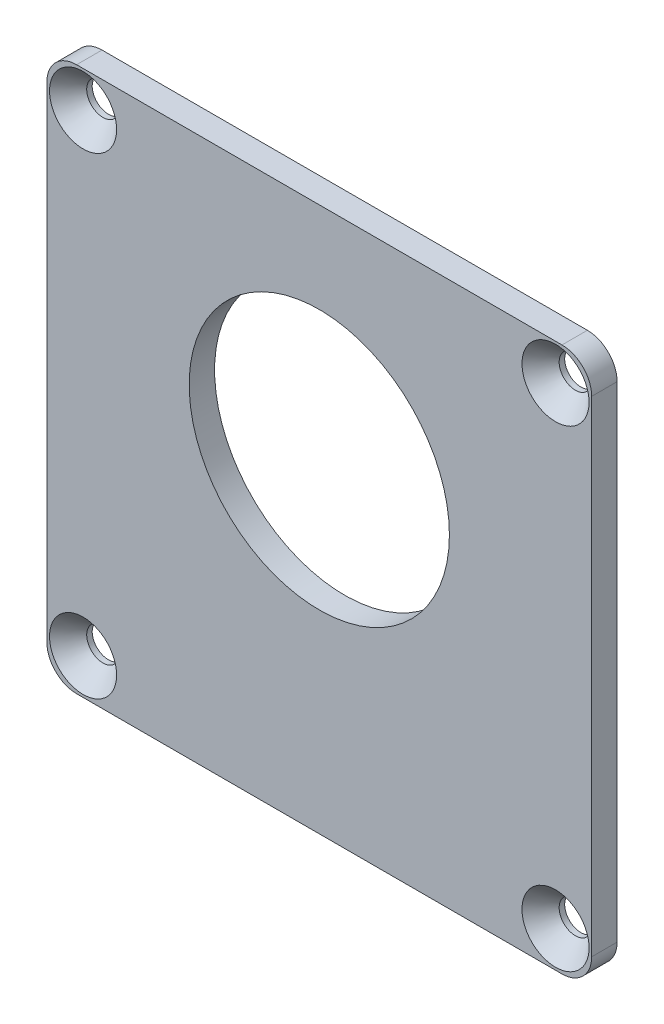
ISO-10303-21;
HEADER;
FILE_DESCRIPTION(('STEP AP214'),'2;1');
FILE_NAME('part.step','',(''),(''),'','','');
FILE_SCHEMA(('AUTOMOTIVE_DESIGN { 1 0 10303 214 1 1 1 1 }'));
ENDSEC;
DATA;
#1=APPLICATION_CONTEXT('core data for automotive mechanical design processes');
#2=APPLICATION_PROTOCOL_DEFINITION('international standard','automotive_design',2000,#1);
#3=PRODUCT_CONTEXT('',#1,'mechanical');
#4=PRODUCT('Part','Part','',(#3));
#5=PRODUCT_RELATED_PRODUCT_CATEGORY('part','',(#4));
#6=PRODUCT_DEFINITION_FORMATION('','',#4);
#7=PRODUCT_DEFINITION_CONTEXT('part definition',#1,'design');
#8=PRODUCT_DEFINITION('design','',#6,#7);
#9=PRODUCT_DEFINITION_SHAPE('','',#8);
#10=(LENGTH_UNIT() NAMED_UNIT(*) SI_UNIT(.MILLI.,.METRE.));
#11=(NAMED_UNIT(*) PLANE_ANGLE_UNIT() SI_UNIT($,.RADIAN.));
#12=(NAMED_UNIT(*) SI_UNIT($,.STERADIAN.) SOLID_ANGLE_UNIT());
#13=UNCERTAINTY_MEASURE_WITH_UNIT(LENGTH_MEASURE(1.E-05),#10,'distance_accuracy_value','');
#14=(GEOMETRIC_REPRESENTATION_CONTEXT(3) GLOBAL_UNCERTAINTY_ASSIGNED_CONTEXT((#13)) GLOBAL_UNIT_ASSIGNED_CONTEXT((#10,
#11,#12)) REPRESENTATION_CONTEXT('',''));
#15=CARTESIAN_POINT('',(0.,0.,0.));
#16=DIRECTION('',(0.,0.,1.));
#17=DIRECTION('',(1.,0.,0.));
#18=AXIS2_PLACEMENT_3D('',#15,#16,#17);
#19=CARTESIAN_POINT('',(-23.876,23.876,1.25));
#20=DIRECTION('',(0.,0.,-1.));
#21=DIRECTION('',(-1.,0.,0.));
#22=AXIS2_PLACEMENT_3D('',#19,#20,#21);
#23=CYLINDRICAL_SURFACE('',#22,2.921);
#24=CARTESIAN_POINT('',(-23.876,23.876,-1.25));
#25=DIRECTION('',(0.,0.,1.));
#26=DIRECTION('',(-1.,0.,0.));
#27=AXIS2_PLACEMENT_3D('',#24,#25,#26);
#28=CIRCLE('',#27,2.921);
#29=CARTESIAN_POINT('',(-23.876,26.797,-1.25));
#30=VERTEX_POINT('',#29);
#31=CARTESIAN_POINT('',(-26.797,23.876,-1.25));
#32=VERTEX_POINT('',#31);
#33=EDGE_CURVE('E142',#30,#32,#28,.T.);
#34=ORIENTED_EDGE('',*,*,#33,.T.);
#35=DIRECTION('',(0.,0.,-1.));
#36=VECTOR('',#35,1.);
#37=CARTESIAN_POINT('',(-26.797,23.876,1.25));
#38=LINE('',#37,#36);
#39=CARTESIAN_POINT('',(-26.797,23.876,1.25));
#40=VERTEX_POINT('',#39);
#41=EDGE_CURVE('E13',#40,#32,#38,.T.);
#42=ORIENTED_EDGE('',*,*,#41,.F.);
#43=CARTESIAN_POINT('',(-23.876,23.876,1.25));
#44=DIRECTION('',(0.,0.,1.));
#45=DIRECTION('',(-1.,0.,0.));
#46=AXIS2_PLACEMENT_3D('',#43,#44,#45);
#47=CIRCLE('',#46,2.921);
#48=CARTESIAN_POINT('',(-23.876,26.797,1.25));
#49=VERTEX_POINT('',#48);
#50=EDGE_CURVE('E157',#49,#40,#47,.T.);
#51=ORIENTED_EDGE('',*,*,#50,.F.);
#52=DIRECTION('',(0.,0.,-1.));
#53=VECTOR('',#52,1.);
#54=CARTESIAN_POINT('',(-23.876,26.797,1.25));
#55=LINE('',#54,#53);
#56=EDGE_CURVE('E138',#49,#30,#55,.T.);
#57=ORIENTED_EDGE('',*,*,#56,.T.);
#58=EDGE_LOOP('',(#34,#42,#51,#57));
#59=FACE_BOUND('',#58,.T.);
#60=ADVANCED_FACE('F46',(#59),#23,.T.);
#61=CARTESIAN_POINT('',(-26.797,23.876,1.25));
#62=DIRECTION('',(1.,0.,0.));
#63=DIRECTION('',(0.,0.,-1.));
#64=AXIS2_PLACEMENT_3D('',#61,#62,#63);
#65=PLANE('',#64);
#66=DIRECTION('',(0.,-1.,0.));
#67=VECTOR('',#66,1.);
#68=CARTESIAN_POINT('',(-26.797,23.876,-1.25));
#69=LINE('',#68,#67);
#70=CARTESIAN_POINT('',(-26.797,-23.876,-1.25));
#71=VERTEX_POINT('',#70);
#72=EDGE_CURVE('E145',#32,#71,#69,.T.);
#73=ORIENTED_EDGE('',*,*,#72,.T.);
#74=DIRECTION('',(0.,0.,-1.));
#75=VECTOR('',#74,1.);
#76=CARTESIAN_POINT('',(-26.797,-23.876,1.25));
#77=LINE('',#76,#75);
#78=CARTESIAN_POINT('',(-26.797,-23.876,1.25));
#79=VERTEX_POINT('',#78);
#80=EDGE_CURVE('E54',#79,#71,#77,.T.);
#81=ORIENTED_EDGE('',*,*,#80,.F.);
#82=DIRECTION('',(0.,-1.,0.));
#83=VECTOR('',#82,1.);
#84=CARTESIAN_POINT('',(-26.797,23.876,1.25));
#85=LINE('',#84,#83);
#86=EDGE_CURVE('E105',#40,#79,#85,.T.);
#87=ORIENTED_EDGE('',*,*,#86,.F.);
#88=ORIENTED_EDGE('',*,*,#41,.T.);
#89=EDGE_LOOP('',(#73,#81,#87,#88));
#90=FACE_BOUND('',#89,.T.);
#91=ADVANCED_FACE('F270',(#90),#65,.F.);
#92=CARTESIAN_POINT('',(-23.876,-23.876,1.25));
#93=DIRECTION('',(0.,0.,-1.));
#94=DIRECTION('',(-1.,0.,0.));
#95=AXIS2_PLACEMENT_3D('',#92,#93,#94);
#96=CYLINDRICAL_SURFACE('',#95,2.921);
#97=CARTESIAN_POINT('',(-23.876,-23.876,-1.25));
#98=DIRECTION('',(0.,0.,1.));
#99=DIRECTION('',(1.,0.,0.));
#100=AXIS2_PLACEMENT_3D('',#97,#98,#99);
#101=CIRCLE('',#100,2.921);
#102=CARTESIAN_POINT('',(-23.876,-26.797,-1.25));
#103=VERTEX_POINT('',#102);
#104=EDGE_CURVE('E148',#71,#103,#101,.T.);
#105=ORIENTED_EDGE('',*,*,#104,.T.);
#106=DIRECTION('',(0.,0.,-1.));
#107=VECTOR('',#106,1.);
#108=CARTESIAN_POINT('',(-23.876,-26.797,1.25));
#109=LINE('',#108,#107);
#110=CARTESIAN_POINT('',(-23.876,-26.797,1.25));
#111=VERTEX_POINT('',#110);
#112=EDGE_CURVE('E164',#111,#103,#109,.T.);
#113=ORIENTED_EDGE('',*,*,#112,.F.);
#114=CARTESIAN_POINT('',(-23.876,-23.876,1.25));
#115=DIRECTION('',(0.,0.,1.));
#116=DIRECTION('',(1.,0.,0.));
#117=AXIS2_PLACEMENT_3D('',#114,#115,#116);
#118=CIRCLE('',#117,2.921);
#119=EDGE_CURVE('E172',#79,#111,#118,.T.);
#120=ORIENTED_EDGE('',*,*,#119,.F.);
#121=ORIENTED_EDGE('',*,*,#80,.T.);
#122=EDGE_LOOP('',(#105,#113,#120,#121));
#123=FACE_BOUND('',#122,.T.);
#124=ADVANCED_FACE('F170',(#123),#96,.T.);
#125=CARTESIAN_POINT('',(-23.876,-26.797,1.25));
#126=DIRECTION('',(0.,1.,0.));
#127=DIRECTION('',(0.,0.,1.));
#128=AXIS2_PLACEMENT_3D('',#125,#126,#127);
#129=PLANE('',#128);
#130=DIRECTION('',(1.,0.,0.));
#131=VECTOR('',#130,1.);
#132=CARTESIAN_POINT('',(-23.876,-26.797,-1.25));
#133=LINE('',#132,#131);
#134=CARTESIAN_POINT('',(23.876,-26.797,-1.25));
#135=VERTEX_POINT('',#134);
#136=EDGE_CURVE('E150',#103,#135,#133,.T.);
#137=ORIENTED_EDGE('',*,*,#136,.T.);
#138=DIRECTION('',(0.,0.,-1.));
#139=VECTOR('',#138,1.);
#140=CARTESIAN_POINT('',(23.876,-26.797,1.25));
#141=LINE('',#140,#139);
#142=CARTESIAN_POINT('',(23.876,-26.797,1.25));
#143=VERTEX_POINT('',#142);
#144=EDGE_CURVE('E161',#143,#135,#141,.T.);
#145=ORIENTED_EDGE('',*,*,#144,.F.);
#146=DIRECTION('',(1.,0.,0.));
#147=VECTOR('',#146,1.);
#148=CARTESIAN_POINT('',(-23.876,-26.797,1.25));
#149=LINE('',#148,#147);
#150=EDGE_CURVE('E184',#111,#143,#149,.T.);
#151=ORIENTED_EDGE('',*,*,#150,.F.);
#152=ORIENTED_EDGE('',*,*,#112,.T.);
#153=EDGE_LOOP('',(#137,#145,#151,#152));
#154=FACE_BOUND('',#153,.T.);
#155=ADVANCED_FACE('F180',(#154),#129,.F.);
#156=CARTESIAN_POINT('',(23.876,-23.876,1.25));
#157=DIRECTION('',(0.,0.,-1.));
#158=DIRECTION('',(-1.,0.,0.));
#159=AXIS2_PLACEMENT_3D('',#156,#157,#158);
#160=CYLINDRICAL_SURFACE('',#159,2.921);
#161=CARTESIAN_POINT('',(23.876,-23.876,-1.25));
#162=DIRECTION('',(0.,0.,1.));
#163=DIRECTION('',(1.,0.,0.));
#164=AXIS2_PLACEMENT_3D('',#161,#162,#163);
#165=CIRCLE('',#164,2.921);
#166=CARTESIAN_POINT('',(26.797,-23.876,-1.25));
#167=VERTEX_POINT('',#166);
#168=EDGE_CURVE('E152',#135,#167,#165,.T.);
#169=ORIENTED_EDGE('',*,*,#168,.T.);
#170=DIRECTION('',(0.,0.,-1.));
#171=VECTOR('',#170,1.);
#172=CARTESIAN_POINT('',(26.797,-23.876,1.25));
#173=LINE('',#172,#171);
#174=CARTESIAN_POINT('',(26.797,-23.876,1.25));
#175=VERTEX_POINT('',#174);
#176=EDGE_CURVE('E133',#175,#167,#173,.T.);
#177=ORIENTED_EDGE('',*,*,#176,.F.);
#178=CARTESIAN_POINT('',(23.876,-23.876,1.25));
#179=DIRECTION('',(0.,0.,1.));
#180=DIRECTION('',(1.,0.,0.));
#181=AXIS2_PLACEMENT_3D('',#178,#179,#180);
#182=CIRCLE('',#181,2.921);
#183=EDGE_CURVE('E124',#143,#175,#182,.T.);
#184=ORIENTED_EDGE('',*,*,#183,.F.);
#185=ORIENTED_EDGE('',*,*,#144,.T.);
#186=EDGE_LOOP('',(#169,#177,#184,#185));
#187=FACE_BOUND('',#186,.T.);
#188=ADVANCED_FACE('F183',(#187),#160,.T.);
#189=CARTESIAN_POINT('',(26.797,23.876,1.25));
#190=DIRECTION('',(-1.,0.,0.));
#191=DIRECTION('',(0.,0.,1.));
#192=AXIS2_PLACEMENT_3D('',#189,#190,#191);
#193=PLANE('',#192);
#194=DIRECTION('',(0.,1.,0.));
#195=VECTOR('',#194,1.);
#196=CARTESIAN_POINT('',(26.797,23.876,-1.25));
#197=LINE('',#196,#195);
#198=CARTESIAN_POINT('',(26.797,23.876,-1.25));
#199=VERTEX_POINT('',#198);
#200=EDGE_CURVE('E132',#167,#199,#197,.T.);
#201=ORIENTED_EDGE('',*,*,#200,.T.);
#202=DIRECTION('',(0.,0.,-1.));
#203=VECTOR('',#202,1.);
#204=CARTESIAN_POINT('',(26.797,23.876,1.25));
#205=LINE('',#204,#203);
#206=CARTESIAN_POINT('',(26.797,23.876,1.25));
#207=VERTEX_POINT('',#206);
#208=EDGE_CURVE('E129',#207,#199,#205,.T.);
#209=ORIENTED_EDGE('',*,*,#208,.F.);
#210=DIRECTION('',(0.,1.,0.));
#211=VECTOR('',#210,1.);
#212=CARTESIAN_POINT('',(26.797,23.876,1.25));
#213=LINE('',#212,#211);
#214=EDGE_CURVE('E118',#175,#207,#213,.T.);
#215=ORIENTED_EDGE('',*,*,#214,.F.);
#216=ORIENTED_EDGE('',*,*,#176,.T.);
#217=EDGE_LOOP('',(#201,#209,#215,#216));
#218=FACE_BOUND('',#217,.T.);
#219=ADVANCED_FACE('F130',(#218),#193,.F.);
#220=CARTESIAN_POINT('',(23.876,23.876,1.25));
#221=DIRECTION('',(0.,0.,-1.));
#222=DIRECTION('',(-1.,0.,0.));
#223=AXIS2_PLACEMENT_3D('',#220,#221,#222);
#224=CYLINDRICAL_SURFACE('',#223,2.921);
#225=CARTESIAN_POINT('',(23.876,23.876,-1.25));
#226=DIRECTION('',(0.,0.,1.));
#227=DIRECTION('',(-1.,0.,0.));
#228=AXIS2_PLACEMENT_3D('',#225,#226,#227);
#229=CIRCLE('',#228,2.921);
#230=CARTESIAN_POINT('',(23.876,26.797,-1.25));
#231=VERTEX_POINT('',#230);
#232=EDGE_CURVE('E91',#199,#231,#229,.T.);
#233=ORIENTED_EDGE('',*,*,#232,.T.);
#234=DIRECTION('',(0.,0.,-1.));
#235=VECTOR('',#234,1.);
#236=CARTESIAN_POINT('',(23.876,26.797,1.25));
#237=LINE('',#236,#235);
#238=CARTESIAN_POINT('',(23.876,26.797,1.25));
#239=VERTEX_POINT('',#238);
#240=EDGE_CURVE('E134',#239,#231,#237,.T.);
#241=ORIENTED_EDGE('',*,*,#240,.F.);
#242=CARTESIAN_POINT('',(23.876,23.876,1.25));
#243=DIRECTION('',(0.,0.,1.));
#244=DIRECTION('',(-1.,0.,0.));
#245=AXIS2_PLACEMENT_3D('',#242,#243,#244);
#246=CIRCLE('',#245,2.921);
#247=EDGE_CURVE('E122',#207,#239,#246,.T.);
#248=ORIENTED_EDGE('',*,*,#247,.F.);
#249=ORIENTED_EDGE('',*,*,#208,.T.);
#250=EDGE_LOOP('',(#233,#241,#248,#249));
#251=FACE_BOUND('',#250,.T.);
#252=ADVANCED_FACE('F136',(#251),#224,.T.);
#253=CARTESIAN_POINT('',(-23.876,26.797,1.25));
#254=DIRECTION('',(0.,-1.,0.));
#255=DIRECTION('',(0.,0.,-1.));
#256=AXIS2_PLACEMENT_3D('',#253,#254,#255);
#257=PLANE('',#256);
#258=DIRECTION('',(-1.,0.,0.));
#259=VECTOR('',#258,1.);
#260=CARTESIAN_POINT('',(-23.876,26.797,-1.25));
#261=LINE('',#260,#259);
#262=EDGE_CURVE('E97',#231,#30,#261,.T.);
#263=ORIENTED_EDGE('',*,*,#262,.T.);
#264=ORIENTED_EDGE('',*,*,#56,.F.);
#265=DIRECTION('',(-1.,0.,0.));
#266=VECTOR('',#265,1.);
#267=CARTESIAN_POINT('',(-23.876,26.797,1.25));
#268=LINE('',#267,#266);
#269=EDGE_CURVE('E62',#239,#49,#268,.T.);
#270=ORIENTED_EDGE('',*,*,#269,.F.);
#271=ORIENTED_EDGE('',*,*,#240,.T.);
#272=EDGE_LOOP('',(#263,#264,#270,#271));
#273=FACE_BOUND('',#272,.T.);
#274=ADVANCED_FACE('F243',(#273),#257,.F.);
#275=CARTESIAN_POINT('',(-23.876,23.876,1.25));
#276=DIRECTION('',(0.,0.,-1.));
#277=DIRECTION('',(-1.,0.,0.));
#278=AXIS2_PLACEMENT_3D('',#275,#276,#277);
#279=PLANE('',#278);
#280=CARTESIAN_POINT('',(0.,5.08,1.25));
#281=DIRECTION('',(0.,0.,1.));
#282=DIRECTION('',(1.,0.,0.));
#283=AXIS2_PLACEMENT_3D('',#280,#281,#282);
#284=CIRCLE('',#283,12.8016);
#285=CARTESIAN_POINT('',(12.8016,5.08,1.25));
#286=VERTEX_POINT('',#285);
#287=EDGE_CURVE('E226',#286,#286,#284,.T.);
#288=ORIENTED_EDGE('',*,*,#287,.F.);
#289=EDGE_LOOP('',(#288));
#290=FACE_BOUND('',#289,.T.);
#291=CARTESIAN_POINT('',(-23.241,23.241,1.25));
#292=DIRECTION('',(0.,0.,1.));
#293=DIRECTION('',(1.,0.,0.));
#294=AXIS2_PLACEMENT_3D('',#291,#292,#293);
#295=CIRCLE('',#294,3.302);
#296=CARTESIAN_POINT('',(-19.939,23.241,1.25));
#297=VERTEX_POINT('',#296);
#298=EDGE_CURVE('E222',#297,#297,#295,.T.);
#299=ORIENTED_EDGE('',*,*,#298,.F.);
#300=EDGE_LOOP('',(#299));
#301=FACE_BOUND('',#300,.T.);
#302=CARTESIAN_POINT('',(23.241,-23.241,1.25));
#303=DIRECTION('',(0.,0.,1.));
#304=DIRECTION('',(1.,0.,0.));
#305=AXIS2_PLACEMENT_3D('',#302,#303,#304);
#306=CIRCLE('',#305,3.302);
#307=CARTESIAN_POINT('',(26.543,-23.241,1.25));
#308=VERTEX_POINT('',#307);
#309=EDGE_CURVE('E213',#308,#308,#306,.T.);
#310=ORIENTED_EDGE('',*,*,#309,.F.);
#311=EDGE_LOOP('',(#310));
#312=FACE_BOUND('',#311,.T.);
#313=CARTESIAN_POINT('',(23.241,23.241,1.25));
#314=DIRECTION('',(0.,0.,1.));
#315=DIRECTION('',(1.,0.,0.));
#316=AXIS2_PLACEMENT_3D('',#313,#314,#315);
#317=CIRCLE('',#316,3.302);
#318=CARTESIAN_POINT('',(26.543,23.241,1.25));
#319=VERTEX_POINT('',#318);
#320=EDGE_CURVE('E204',#319,#319,#317,.T.);
#321=ORIENTED_EDGE('',*,*,#320,.F.);
#322=EDGE_LOOP('',(#321));
#323=FACE_BOUND('',#322,.T.);
#324=CARTESIAN_POINT('',(-23.241,-23.241,1.25));
#325=DIRECTION('',(0.,0.,1.));
#326=DIRECTION('',(1.,0.,0.));
#327=AXIS2_PLACEMENT_3D('',#324,#325,#326);
#328=CIRCLE('',#327,3.302);
#329=CARTESIAN_POINT('',(-19.939,-23.241,1.25));
#330=VERTEX_POINT('',#329);
#331=EDGE_CURVE('E195',#330,#330,#328,.T.);
#332=ORIENTED_EDGE('',*,*,#331,.F.);
#333=EDGE_LOOP('',(#332));
#334=FACE_BOUND('',#333,.T.);
#335=ORIENTED_EDGE('',*,*,#50,.T.);
#336=ORIENTED_EDGE('',*,*,#86,.T.);
#337=ORIENTED_EDGE('',*,*,#119,.T.);
#338=ORIENTED_EDGE('',*,*,#150,.T.);
#339=ORIENTED_EDGE('',*,*,#183,.T.);
#340=ORIENTED_EDGE('',*,*,#214,.T.);
#341=ORIENTED_EDGE('',*,*,#247,.T.);
#342=ORIENTED_EDGE('',*,*,#269,.T.);
#343=EDGE_LOOP('',(#335,#336,#337,#338,#339,#340,#341,#342));
#344=FACE_BOUND('',#343,.T.);
#345=ADVANCED_FACE('F120',(#290,#301,#312,#323,#334,#344),#279,.F.);
#346=CARTESIAN_POINT('',(-23.876,23.876,-1.25));
#347=DIRECTION('',(0.,0.,-1.));
#348=DIRECTION('',(-1.,0.,0.));
#349=AXIS2_PLACEMENT_3D('',#346,#347,#348);
#350=PLANE('',#349);
#351=CARTESIAN_POINT('',(0.,5.08,-1.25));
#352=DIRECTION('',(0.,0.,1.));
#353=DIRECTION('',(1.,0.,0.));
#354=AXIS2_PLACEMENT_3D('',#351,#352,#353);
#355=CIRCLE('',#354,12.8016);
#356=CARTESIAN_POINT('',(12.8016,5.08,-1.25));
#357=VERTEX_POINT('',#356);
#358=EDGE_CURVE('E225',#357,#357,#355,.T.);
#359=ORIENTED_EDGE('',*,*,#358,.T.);
#360=EDGE_LOOP('',(#359));
#361=FACE_BOUND('',#360,.T.);
#362=CARTESIAN_POINT('',(-23.241,23.241,-1.25));
#363=DIRECTION('',(0.,0.,1.));
#364=DIRECTION('',(1.,0.,0.));
#365=AXIS2_PLACEMENT_3D('',#362,#363,#364);
#366=CIRCLE('',#365,1.6002);
#367=CARTESIAN_POINT('',(-21.6408,23.241,-1.25));
#368=VERTEX_POINT('',#367);
#369=EDGE_CURVE('E216',#368,#368,#366,.T.);
#370=ORIENTED_EDGE('',*,*,#369,.T.);
#371=EDGE_LOOP('',(#370));
#372=FACE_BOUND('',#371,.T.);
#373=CARTESIAN_POINT('',(23.241,-23.241,-1.25));
#374=DIRECTION('',(0.,0.,1.));
#375=DIRECTION('',(1.,0.,0.));
#376=AXIS2_PLACEMENT_3D('',#373,#374,#375);
#377=CIRCLE('',#376,1.6002);
#378=CARTESIAN_POINT('',(24.8412,-23.241,-1.25));
#379=VERTEX_POINT('',#378);
#380=EDGE_CURVE('E207',#379,#379,#377,.T.);
#381=ORIENTED_EDGE('',*,*,#380,.T.);
#382=EDGE_LOOP('',(#381));
#383=FACE_BOUND('',#382,.T.);
#384=CARTESIAN_POINT('',(23.241,23.241,-1.25));
#385=DIRECTION('',(0.,0.,1.));
#386=DIRECTION('',(1.,0.,0.));
#387=AXIS2_PLACEMENT_3D('',#384,#385,#386);
#388=CIRCLE('',#387,1.6002);
#389=CARTESIAN_POINT('',(24.8412,23.241,-1.25));
#390=VERTEX_POINT('',#389);
#391=EDGE_CURVE('E198',#390,#390,#388,.T.);
#392=ORIENTED_EDGE('',*,*,#391,.T.);
#393=EDGE_LOOP('',(#392));
#394=FACE_BOUND('',#393,.T.);
#395=CARTESIAN_POINT('',(-23.241,-23.241,-1.25));
#396=DIRECTION('',(0.,0.,1.));
#397=DIRECTION('',(1.,0.,0.));
#398=AXIS2_PLACEMENT_3D('',#395,#396,#397);
#399=CIRCLE('',#398,1.6002);
#400=CARTESIAN_POINT('',(-21.6408,-23.241,-1.25));
#401=VERTEX_POINT('',#400);
#402=EDGE_CURVE('E146',#401,#401,#399,.T.);
#403=ORIENTED_EDGE('',*,*,#402,.T.);
#404=EDGE_LOOP('',(#403));
#405=FACE_BOUND('',#404,.T.);
#406=ORIENTED_EDGE('',*,*,#33,.F.);
#407=ORIENTED_EDGE('',*,*,#262,.F.);
#408=ORIENTED_EDGE('',*,*,#232,.F.);
#409=ORIENTED_EDGE('',*,*,#200,.F.);
#410=ORIENTED_EDGE('',*,*,#168,.F.);
#411=ORIENTED_EDGE('',*,*,#136,.F.);
#412=ORIENTED_EDGE('',*,*,#104,.F.);
#413=ORIENTED_EDGE('',*,*,#72,.F.);
#414=EDGE_LOOP('',(#406,#407,#408,#409,#410,#411,#412,#413));
#415=FACE_BOUND('',#414,.T.);
#416=ADVANCED_FACE('F176',(#361,#372,#383,#394,#405,#415),#350,.T.);
#417=CARTESIAN_POINT('',(-23.241,-23.241,1.25));
#418=DIRECTION('',(0.,0.,1.));
#419=DIRECTION('',(1.,0.,0.));
#420=AXIS2_PLACEMENT_3D('',#417,#418,#419);
#421=CYLINDRICAL_SURFACE('',#420,1.6002);
#422=ORIENTED_EDGE('',*,*,#402,.F.);
#423=EDGE_LOOP('',(#422));
#424=FACE_BOUND('',#423,.T.);
#425=CARTESIAN_POINT('',(-23.241,-23.241,-0.707696955408714));
#426=DIRECTION('',(0.,0.,1.));
#427=DIRECTION('',(1.,0.,0.));
#428=AXIS2_PLACEMENT_3D('',#425,#426,#427);
#429=CIRCLE('',#428,1.6002);
#430=CARTESIAN_POINT('',(-21.6408,-23.241,-0.707696955408714));
#431=VERTEX_POINT('',#430);
#432=EDGE_CURVE('E192',#431,#431,#429,.T.);
#433=ORIENTED_EDGE('',*,*,#432,.T.);
#434=EDGE_LOOP('',(#433));
#435=FACE_BOUND('',#434,.T.);
#436=ADVANCED_FACE('F256',(#424,#435),#421,.F.);
#437=CARTESIAN_POINT('',(-23.241,-23.241,1.25));
#438=DIRECTION('',(0.,0.,1.));
#439=DIRECTION('',(1.,0.,0.));
#440=AXIS2_PLACEMENT_3D('',#437,#438,#439);
#441=CONICAL_SURFACE('',#440,3.302,0.715584993317675);
#442=ORIENTED_EDGE('',*,*,#432,.F.);
#443=EDGE_LOOP('',(#442));
#444=FACE_BOUND('',#443,.T.);
#445=ORIENTED_EDGE('',*,*,#331,.T.);
#446=EDGE_LOOP('',(#445));
#447=FACE_BOUND('',#446,.T.);
#448=ADVANCED_FACE('F253',(#444,#447),#441,.F.);
#449=CARTESIAN_POINT('',(23.241,23.241,1.25));
#450=DIRECTION('',(0.,0.,1.));
#451=DIRECTION('',(1.,0.,0.));
#452=AXIS2_PLACEMENT_3D('',#449,#450,#451);
#453=CYLINDRICAL_SURFACE('',#452,1.6002);
#454=ORIENTED_EDGE('',*,*,#391,.F.);
#455=EDGE_LOOP('',(#454));
#456=FACE_BOUND('',#455,.T.);
#457=CARTESIAN_POINT('',(23.241,23.241,-0.707696955408714));
#458=DIRECTION('',(0.,0.,1.));
#459=DIRECTION('',(1.,0.,0.));
#460=AXIS2_PLACEMENT_3D('',#457,#458,#459);
#461=CIRCLE('',#460,1.6002);
#462=CARTESIAN_POINT('',(24.8412,23.241,-0.707696955408714));
#463=VERTEX_POINT('',#462);
#464=EDGE_CURVE('E201',#463,#463,#461,.T.);
#465=ORIENTED_EDGE('',*,*,#464,.T.);
#466=EDGE_LOOP('',(#465));
#467=FACE_BOUND('',#466,.T.);
#468=ADVANCED_FACE('F255',(#456,#467),#453,.F.);
#469=CARTESIAN_POINT('',(23.241,23.241,1.25));
#470=DIRECTION('',(0.,0.,1.));
#471=DIRECTION('',(1.,0.,0.));
#472=AXIS2_PLACEMENT_3D('',#469,#470,#471);
#473=CONICAL_SURFACE('',#472,3.302,0.715584993317675);
#474=ORIENTED_EDGE('',*,*,#464,.F.);
#475=EDGE_LOOP('',(#474));
#476=FACE_BOUND('',#475,.T.);
#477=ORIENTED_EDGE('',*,*,#320,.T.);
#478=EDGE_LOOP('',(#477));
#479=FACE_BOUND('',#478,.T.);
#480=ADVANCED_FACE('F263',(#476,#479),#473,.F.);
#481=CARTESIAN_POINT('',(23.241,-23.241,1.25));
#482=DIRECTION('',(0.,0.,1.));
#483=DIRECTION('',(1.,0.,0.));
#484=AXIS2_PLACEMENT_3D('',#481,#482,#483);
#485=CYLINDRICAL_SURFACE('',#484,1.6002);
#486=ORIENTED_EDGE('',*,*,#380,.F.);
#487=EDGE_LOOP('',(#486));
#488=FACE_BOUND('',#487,.T.);
#489=CARTESIAN_POINT('',(23.241,-23.241,-0.707696955408714));
#490=DIRECTION('',(0.,0.,1.));
#491=DIRECTION('',(1.,0.,0.));
#492=AXIS2_PLACEMENT_3D('',#489,#490,#491);
#493=CIRCLE('',#492,1.6002);
#494=CARTESIAN_POINT('',(24.8412,-23.241,-0.707696955408714));
#495=VERTEX_POINT('',#494);
#496=EDGE_CURVE('E210',#495,#495,#493,.T.);
#497=ORIENTED_EDGE('',*,*,#496,.T.);
#498=EDGE_LOOP('',(#497));
#499=FACE_BOUND('',#498,.T.);
#500=ADVANCED_FACE('F344',(#488,#499),#485,.F.);
#501=CARTESIAN_POINT('',(23.241,-23.241,1.25));
#502=DIRECTION('',(0.,0.,1.));
#503=DIRECTION('',(1.,0.,0.));
#504=AXIS2_PLACEMENT_3D('',#501,#502,#503);
#505=CONICAL_SURFACE('',#504,3.302,0.715584993317675);
#506=ORIENTED_EDGE('',*,*,#496,.F.);
#507=EDGE_LOOP('',(#506));
#508=FACE_BOUND('',#507,.T.);
#509=ORIENTED_EDGE('',*,*,#309,.T.);
#510=EDGE_LOOP('',(#509));
#511=FACE_BOUND('',#510,.T.);
#512=ADVANCED_FACE('F354',(#508,#511),#505,.F.);
#513=CARTESIAN_POINT('',(-23.241,23.241,1.25));
#514=DIRECTION('',(0.,0.,1.));
#515=DIRECTION('',(1.,0.,0.));
#516=AXIS2_PLACEMENT_3D('',#513,#514,#515);
#517=CYLINDRICAL_SURFACE('',#516,1.6002);
#518=ORIENTED_EDGE('',*,*,#369,.F.);
#519=EDGE_LOOP('',(#518));
#520=FACE_BOUND('',#519,.T.);
#521=CARTESIAN_POINT('',(-23.241,23.241,-0.707696955408714));
#522=DIRECTION('',(0.,0.,1.));
#523=DIRECTION('',(1.,0.,0.));
#524=AXIS2_PLACEMENT_3D('',#521,#522,#523);
#525=CIRCLE('',#524,1.6002);
#526=CARTESIAN_POINT('',(-21.6408,23.241,-0.707696955408714));
#527=VERTEX_POINT('',#526);
#528=EDGE_CURVE('E219',#527,#527,#525,.T.);
#529=ORIENTED_EDGE('',*,*,#528,.T.);
#530=EDGE_LOOP('',(#529));
#531=FACE_BOUND('',#530,.T.);
#532=ADVANCED_FACE('F364',(#520,#531),#517,.F.);
#533=CARTESIAN_POINT('',(-23.241,23.241,1.25));
#534=DIRECTION('',(0.,0.,1.));
#535=DIRECTION('',(1.,0.,0.));
#536=AXIS2_PLACEMENT_3D('',#533,#534,#535);
#537=CONICAL_SURFACE('',#536,3.302,0.715584993317675);
#538=ORIENTED_EDGE('',*,*,#528,.F.);
#539=EDGE_LOOP('',(#538));
#540=FACE_BOUND('',#539,.T.);
#541=ORIENTED_EDGE('',*,*,#298,.T.);
#542=EDGE_LOOP('',(#541));
#543=FACE_BOUND('',#542,.T.);
#544=ADVANCED_FACE('F237',(#540,#543),#537,.F.);
#545=CARTESIAN_POINT('',(0.,5.08,-1.25));
#546=DIRECTION('',(0.,0.,1.));
#547=DIRECTION('',(1.,0.,0.));
#548=AXIS2_PLACEMENT_3D('',#545,#546,#547);
#549=CYLINDRICAL_SURFACE('',#548,12.8016);
#550=ORIENTED_EDGE('',*,*,#358,.F.);
#551=EDGE_LOOP('',(#550));
#552=FACE_BOUND('',#551,.T.);
#553=ORIENTED_EDGE('',*,*,#287,.T.);
#554=EDGE_LOOP('',(#553));
#555=FACE_BOUND('',#554,.T.);
#556=ADVANCED_FACE('F234',(#552,#555),#549,.F.);
#557=CLOSED_SHELL('',(#60,#91,#124,#155,#188,#219,#252,#274,#345,#416,#436,#448,#468,#480,#500,
#512,#532,#544,#556));
#558=MANIFOLD_SOLID_BREP('B2',#557);
#559=ADVANCED_BREP_SHAPE_REPRESENTATION('',(#18,#558),#14);
#560=SHAPE_DEFINITION_REPRESENTATION(#9,#559);
ENDSEC;
END-ISO-10303-21;
